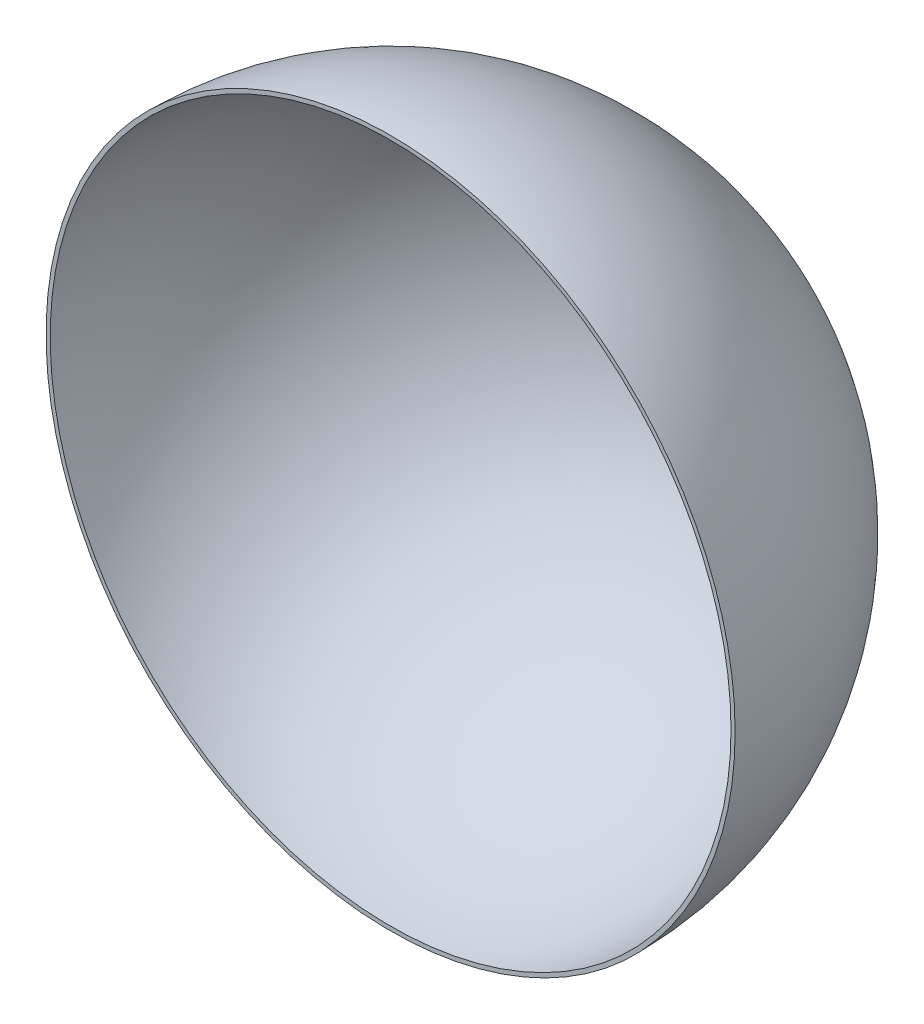
ISO-10303-21;
HEADER;
FILE_DESCRIPTION(('STEP AP214'),'2;1');
FILE_NAME('part.step','',(''),(''),'','','');
FILE_SCHEMA(('AUTOMOTIVE_DESIGN { 1 0 10303 214 1 1 1 1 }'));
ENDSEC;
DATA;
#1=APPLICATION_CONTEXT('core data for automotive mechanical design processes');
#2=APPLICATION_PROTOCOL_DEFINITION('international standard','automotive_design',2000,#1);
#3=PRODUCT_CONTEXT('',#1,'mechanical');
#4=PRODUCT('Part','Part','',(#3));
#5=PRODUCT_RELATED_PRODUCT_CATEGORY('part','',(#4));
#6=PRODUCT_DEFINITION_FORMATION('','',#4);
#7=PRODUCT_DEFINITION_CONTEXT('part definition',#1,'design');
#8=PRODUCT_DEFINITION('design','',#6,#7);
#9=PRODUCT_DEFINITION_SHAPE('','',#8);
#10=(LENGTH_UNIT() NAMED_UNIT(*) SI_UNIT(.MILLI.,.METRE.));
#11=(NAMED_UNIT(*) PLANE_ANGLE_UNIT() SI_UNIT($,.RADIAN.));
#12=(NAMED_UNIT(*) SI_UNIT($,.STERADIAN.) SOLID_ANGLE_UNIT());
#13=UNCERTAINTY_MEASURE_WITH_UNIT(LENGTH_MEASURE(1.E-05),#10,'distance_accuracy_value','');
#14=(GEOMETRIC_REPRESENTATION_CONTEXT(3) GLOBAL_UNCERTAINTY_ASSIGNED_CONTEXT((#13)) GLOBAL_UNIT_ASSIGNED_CONTEXT((#10,
#11,#12)) REPRESENTATION_CONTEXT('',''));
#15=CARTESIAN_POINT('',(0.,0.,0.));
#16=DIRECTION('',(0.,0.,1.));
#17=DIRECTION('',(1.,0.,0.));
#18=AXIS2_PLACEMENT_3D('',#15,#16,#17);
#19=CARTESIAN_POINT('',(0.,0.,0.));
#20=DIRECTION('',(-1.,0.,0.));
#21=DIRECTION('',(0.,-1.,0.));
#22=AXIS2_PLACEMENT_3D('',#19,#20,#21);
#23=SPHERICAL_SURFACE('',#22,250.);
#24=CARTESIAN_POINT('',(0.,0.,0.));
#25=DIRECTION('',(0.,0.,-1.));
#26=DIRECTION('',(1.,0.,0.));
#27=AXIS2_PLACEMENT_3D('',#24,#25,#26);
#28=SPHERICAL_SURFACE('',#27,250.);
#29=CARTESIAN_POINT('',(0.,0.,0.));
#30=DIRECTION('',(0.,0.,-1.));
#31=DIRECTION('',(1.,0.,0.));
#32=AXIS2_PLACEMENT_3D('',#29,#30,#31);
#33=CIRCLE('',#32,250.);
#34=CARTESIAN_POINT('',(250.,0.,0.));
#35=VERTEX_POINT('',#34);
#36=EDGE_CURVE('E42',#35,#35,#33,.T.);
#37=ORIENTED_EDGE('',*,*,#36,.T.);
#38=EDGE_LOOP('',(#37));
#39=FACE_BOUND('',#38,.T.);
#40=ADVANCED_FACE('F35',(#39),#28,.T.);
#41=CARTESIAN_POINT('',(0.,0.,0.));
#42=DIRECTION('',(-1.,0.,0.));
#43=DIRECTION('',(0.,-1.,0.));
#44=AXIS2_PLACEMENT_3D('',#41,#42,#43);
#45=SPHERICAL_SURFACE('',#44,247.);
#46=CARTESIAN_POINT('',(0.,0.,0.));
#47=DIRECTION('',(0.,0.,-1.));
#48=DIRECTION('',(1.,0.,0.));
#49=AXIS2_PLACEMENT_3D('',#46,#47,#48);
#50=SPHERICAL_SURFACE('',#49,247.);
#51=CARTESIAN_POINT('',(0.,0.,0.));
#52=DIRECTION('',(0.,0.,-1.));
#53=DIRECTION('',(1.,0.,0.));
#54=AXIS2_PLACEMENT_3D('',#51,#52,#53);
#55=CIRCLE('',#54,247.);
#56=CARTESIAN_POINT('',(247.,0.,0.));
#57=VERTEX_POINT('',#56);
#58=EDGE_CURVE('E10',#57,#57,#55,.T.);
#59=ORIENTED_EDGE('',*,*,#58,.F.);
#60=EDGE_LOOP('',(#59));
#61=FACE_BOUND('',#60,.T.);
#62=ADVANCED_FACE('F37',(#61),#50,.F.);
#63=CARTESIAN_POINT('',(0.,0.,0.));
#64=DIRECTION('',(0.,0.,-1.));
#65=DIRECTION('',(1.,0.,0.));
#66=AXIS2_PLACEMENT_3D('',#63,#64,#65);
#67=PLANE('',#66);
#68=ORIENTED_EDGE('',*,*,#36,.F.);
#69=EDGE_LOOP('',(#68));
#70=FACE_BOUND('',#69,.T.);
#71=ORIENTED_EDGE('',*,*,#58,.T.);
#72=EDGE_LOOP('',(#71));
#73=FACE_BOUND('',#72,.T.);
#74=ADVANCED_FACE('F49',(#70,#73),#67,.F.);
#75=CLOSED_SHELL('',(#40,#62,#74));
#76=MANIFOLD_SOLID_BREP('B2',#75);
#77=ADVANCED_BREP_SHAPE_REPRESENTATION('',(#18,#76),#14);
#78=SHAPE_DEFINITION_REPRESENTATION(#9,#77);
ENDSEC;
END-ISO-10303-21;
